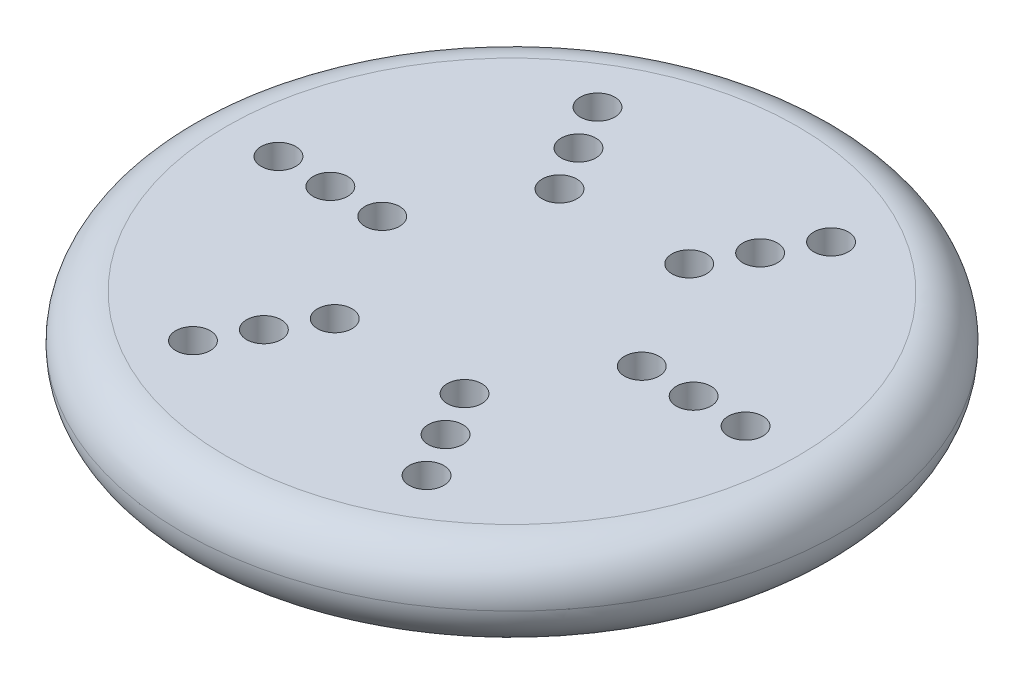
ISO-10303-21;
HEADER;
FILE_DESCRIPTION(('STEP AP214'),'2;1');
FILE_NAME('part.step','',(''),(''),'','','');
FILE_SCHEMA(('AUTOMOTIVE_DESIGN { 1 0 10303 214 1 1 1 1 }'));
ENDSEC;
DATA;
#1=APPLICATION_CONTEXT('core data for automotive mechanical design processes');
#2=APPLICATION_PROTOCOL_DEFINITION('international standard','automotive_design',2000,#1);
#3=PRODUCT_CONTEXT('',#1,'mechanical');
#4=PRODUCT('Part','Part','',(#3));
#5=PRODUCT_RELATED_PRODUCT_CATEGORY('part','',(#4));
#6=PRODUCT_DEFINITION_FORMATION('','',#4);
#7=PRODUCT_DEFINITION_CONTEXT('part definition',#1,'design');
#8=PRODUCT_DEFINITION('design','',#6,#7);
#9=PRODUCT_DEFINITION_SHAPE('','',#8);
#10=(LENGTH_UNIT() NAMED_UNIT(*) SI_UNIT(.MILLI.,.METRE.));
#11=(NAMED_UNIT(*) PLANE_ANGLE_UNIT() SI_UNIT($,.RADIAN.));
#12=(NAMED_UNIT(*) SI_UNIT($,.STERADIAN.) SOLID_ANGLE_UNIT());
#13=UNCERTAINTY_MEASURE_WITH_UNIT(LENGTH_MEASURE(1.E-05),#10,'distance_accuracy_value','');
#14=(GEOMETRIC_REPRESENTATION_CONTEXT(3) GLOBAL_UNCERTAINTY_ASSIGNED_CONTEXT((#13)) GLOBAL_UNIT_ASSIGNED_CONTEXT((#10,
#11,#12)) REPRESENTATION_CONTEXT('',''));
#15=CARTESIAN_POINT('',(0.,0.,0.));
#16=DIRECTION('',(0.,0.,1.));
#17=DIRECTION('',(1.,0.,0.));
#18=AXIS2_PLACEMENT_3D('',#15,#16,#17);
#19=CARTESIAN_POINT('',(0.,5.08,0.));
#20=DIRECTION('',(0.,1.,0.));
#21=DIRECTION('',(0.,0.,1.));
#22=AXIS2_PLACEMENT_3D('',#19,#20,#21);
#23=PLANE('',#22);
#24=CARTESIAN_POINT('',(0.,5.08,0.));
#25=DIRECTION('',(0.,1.,0.));
#26=DIRECTION('',(0.,0.,1.));
#27=AXIS2_PLACEMENT_3D('',#24,#25,#26);
#28=CIRCLE('',#27,16.51);
#29=CARTESIAN_POINT('',(0.,5.08,16.51));
#30=VERTEX_POINT('',#29);
#31=EDGE_CURVE('E10',#30,#30,#28,.T.);
#32=ORIENTED_EDGE('',*,*,#31,.T.);
#33=EDGE_LOOP('',(#32));
#34=FACE_BOUND('',#33,.T.);
#35=CARTESIAN_POINT('',(6.74999999999997,5.08,11.6913429510899));
#36=DIRECTION('',(0.,1.,0.));
#37=DIRECTION('',(0.,0.,1.));
#38=AXIS2_PLACEMENT_3D('',#35,#36,#37);
#39=CIRCLE('',#38,1.);
#40=CARTESIAN_POINT('',(6.74999999999997,5.08,12.6913429510899));
#41=VERTEX_POINT('',#40);
#42=EDGE_CURVE('E69',#41,#41,#39,.T.);
#43=ORIENTED_EDGE('',*,*,#42,.F.);
#44=EDGE_LOOP('',(#43));
#45=FACE_BOUND('',#44,.T.);
#46=CARTESIAN_POINT('',(6.75000000000014,5.08,-11.6913429510898));
#47=DIRECTION('',(0.,1.,0.));
#48=DIRECTION('',(0.,0.,1.));
#49=AXIS2_PLACEMENT_3D('',#46,#47,#48);
#50=CIRCLE('',#49,1.);
#51=CARTESIAN_POINT('',(6.75000000000014,5.08,-10.6913429510898));
#52=VERTEX_POINT('',#51);
#53=EDGE_CURVE('E103',#52,#52,#50,.T.);
#54=ORIENTED_EDGE('',*,*,#53,.F.);
#55=EDGE_LOOP('',(#54));
#56=FACE_BOUND('',#55,.T.);
#57=CARTESIAN_POINT('',(5.25000000000011,5.08,-9.09326673973654));
#58=DIRECTION('',(0.,1.,0.));
#59=DIRECTION('',(0.,0.,1.));
#60=AXIS2_PLACEMENT_3D('',#57,#58,#59);
#61=CIRCLE('',#60,1.);
#62=CARTESIAN_POINT('',(5.25000000000011,5.08,-8.09326673973654));
#63=VERTEX_POINT('',#62);
#64=EDGE_CURVE('E95',#63,#63,#61,.T.);
#65=ORIENTED_EDGE('',*,*,#64,.F.);
#66=EDGE_LOOP('',(#65));
#67=FACE_BOUND('',#66,.T.);
#68=CARTESIAN_POINT('',(3.75000000000008,5.08,-6.49519052838324));
#69=DIRECTION('',(0.,1.,0.));
#70=DIRECTION('',(0.,0.,1.));
#71=AXIS2_PLACEMENT_3D('',#68,#69,#70);
#72=CIRCLE('',#71,1.);
#73=CARTESIAN_POINT('',(3.75000000000008,5.08,-5.49519052838324));
#74=VERTEX_POINT('',#73);
#75=EDGE_CURVE('E87',#74,#74,#72,.T.);
#76=ORIENTED_EDGE('',*,*,#75,.F.);
#77=EDGE_LOOP('',(#76));
#78=FACE_BOUND('',#77,.T.);
#79=CARTESIAN_POINT('',(13.5,5.08,0.));
#80=DIRECTION('',(0.,1.,0.));
#81=DIRECTION('',(0.,0.,1.));
#82=AXIS2_PLACEMENT_3D('',#79,#80,#81);
#83=CIRCLE('',#82,1.);
#84=CARTESIAN_POINT('',(13.5,5.08,1.));
#85=VERTEX_POINT('',#84);
#86=EDGE_CURVE('E78',#85,#85,#83,.T.);
#87=ORIENTED_EDGE('',*,*,#86,.F.);
#88=EDGE_LOOP('',(#87));
#89=FACE_BOUND('',#88,.T.);
#90=CARTESIAN_POINT('',(10.5,5.08,0.));
#91=DIRECTION('',(0.,1.,0.));
#92=DIRECTION('',(0.,0.,1.));
#93=AXIS2_PLACEMENT_3D('',#90,#91,#92);
#94=CIRCLE('',#93,1.);
#95=CARTESIAN_POINT('',(10.5,5.08,1.));
#96=VERTEX_POINT('',#95);
#97=EDGE_CURVE('E79',#96,#96,#94,.T.);
#98=ORIENTED_EDGE('',*,*,#97,.F.);
#99=EDGE_LOOP('',(#98));
#100=FACE_BOUND('',#99,.T.);
#101=CARTESIAN_POINT('',(7.5,5.08,0.));
#102=DIRECTION('',(0.,1.,0.));
#103=DIRECTION('',(0.,0.,1.));
#104=AXIS2_PLACEMENT_3D('',#101,#102,#103);
#105=CIRCLE('',#104,1.);
#106=CARTESIAN_POINT('',(7.5,5.08,1.));
#107=VERTEX_POINT('',#106);
#108=EDGE_CURVE('E127',#107,#107,#105,.T.);
#109=ORIENTED_EDGE('',*,*,#108,.F.);
#110=EDGE_LOOP('',(#109));
#111=FACE_BOUND('',#110,.T.);
#112=CARTESIAN_POINT('',(3.74999999999998,5.08,6.4951905283833));
#113=DIRECTION('',(0.,1.,0.));
#114=DIRECTION('',(0.,0.,1.));
#115=AXIS2_PLACEMENT_3D('',#112,#113,#114);
#116=CIRCLE('',#115,1.);
#117=CARTESIAN_POINT('',(3.74999999999998,5.08,7.4951905283833));
#118=VERTEX_POINT('',#117);
#119=EDGE_CURVE('E119',#118,#118,#116,.T.);
#120=ORIENTED_EDGE('',*,*,#119,.F.);
#121=EDGE_LOOP('',(#120));
#122=FACE_BOUND('',#121,.T.);
#123=CARTESIAN_POINT('',(5.24999999999998,5.08,9.09326673973662));
#124=DIRECTION('',(0.,1.,0.));
#125=DIRECTION('',(0.,0.,1.));
#126=AXIS2_PLACEMENT_3D('',#123,#124,#125);
#127=CIRCLE('',#126,1.);
#128=CARTESIAN_POINT('',(5.24999999999998,5.08,10.0932667397366));
#129=VERTEX_POINT('',#128);
#130=EDGE_CURVE('E111',#129,#129,#127,.T.);
#131=ORIENTED_EDGE('',*,*,#130,.F.);
#132=EDGE_LOOP('',(#131));
#133=FACE_BOUND('',#132,.T.);
#134=CARTESIAN_POINT('',(-5.25000000000004,5.08,9.09326673973658));
#135=DIRECTION('',(0.,1.,0.));
#136=DIRECTION('',(0.,0.,1.));
#137=AXIS2_PLACEMENT_3D('',#134,#135,#136);
#138=CIRCLE('',#137,1.);
#139=CARTESIAN_POINT('',(-5.25000000000004,5.08,10.0932667397366));
#140=VERTEX_POINT('',#139);
#141=EDGE_CURVE('E61',#140,#140,#138,.T.);
#142=ORIENTED_EDGE('',*,*,#141,.F.);
#143=EDGE_LOOP('',(#142));
#144=FACE_BOUND('',#143,.T.);
#145=CARTESIAN_POINT('',(-3.75000000000003,5.08,6.49519052838327));
#146=DIRECTION('',(0.,1.,0.));
#147=DIRECTION('',(0.,0.,1.));
#148=AXIS2_PLACEMENT_3D('',#145,#146,#147);
#149=CIRCLE('',#148,1.);
#150=CARTESIAN_POINT('',(-3.75000000000003,5.08,7.49519052838327));
#151=VERTEX_POINT('',#150);
#152=EDGE_CURVE('E159',#151,#151,#149,.T.);
#153=ORIENTED_EDGE('',*,*,#152,.F.);
#154=EDGE_LOOP('',(#153));
#155=FACE_BOUND('',#154,.T.);
#156=CARTESIAN_POINT('',(-13.5,5.08,0.));
#157=DIRECTION('',(0.,1.,0.));
#158=DIRECTION('',(0.,0.,1.));
#159=AXIS2_PLACEMENT_3D('',#156,#157,#158);
#160=CIRCLE('',#159,1.);
#161=CARTESIAN_POINT('',(-13.5,5.08,1.));
#162=VERTEX_POINT('',#161);
#163=EDGE_CURVE('E151',#162,#162,#160,.T.);
#164=ORIENTED_EDGE('',*,*,#163,.F.);
#165=EDGE_LOOP('',(#164));
#166=FACE_BOUND('',#165,.T.);
#167=CARTESIAN_POINT('',(-10.5,5.08,0.));
#168=DIRECTION('',(0.,1.,0.));
#169=DIRECTION('',(0.,0.,1.));
#170=AXIS2_PLACEMENT_3D('',#167,#168,#169);
#171=CIRCLE('',#170,1.);
#172=CARTESIAN_POINT('',(-10.5,5.08,1.));
#173=VERTEX_POINT('',#172);
#174=EDGE_CURVE('E142',#173,#173,#171,.T.);
#175=ORIENTED_EDGE('',*,*,#174,.F.);
#176=EDGE_LOOP('',(#175));
#177=FACE_BOUND('',#176,.T.);
#178=CARTESIAN_POINT('',(-7.5,5.08,0.));
#179=DIRECTION('',(0.,1.,0.));
#180=DIRECTION('',(0.,0.,1.));
#181=AXIS2_PLACEMENT_3D('',#178,#179,#180);
#182=CIRCLE('',#181,1.);
#183=CARTESIAN_POINT('',(-7.5,5.08,1.));
#184=VERTEX_POINT('',#183);
#185=EDGE_CURVE('E143',#184,#184,#182,.T.);
#186=ORIENTED_EDGE('',*,*,#185,.F.);
#187=EDGE_LOOP('',(#186));
#188=FACE_BOUND('',#187,.T.);
#189=CARTESIAN_POINT('',(-3.74999999999994,5.08,-6.49519052838332));
#190=DIRECTION('',(0.,1.,0.));
#191=DIRECTION('',(0.,0.,1.));
#192=AXIS2_PLACEMENT_3D('',#189,#190,#191);
#193=CIRCLE('',#192,1.);
#194=CARTESIAN_POINT('',(-3.74999999999994,5.08,-5.49519052838332));
#195=VERTEX_POINT('',#194);
#196=EDGE_CURVE('E189',#195,#195,#193,.T.);
#197=ORIENTED_EDGE('',*,*,#196,.F.);
#198=EDGE_LOOP('',(#197));
#199=FACE_BOUND('',#198,.T.);
#200=CARTESIAN_POINT('',(-5.24999999999992,5.08,-9.09326673973665));
#201=DIRECTION('',(0.,1.,0.));
#202=DIRECTION('',(0.,0.,1.));
#203=AXIS2_PLACEMENT_3D('',#200,#201,#202);
#204=CIRCLE('',#203,1.);
#205=CARTESIAN_POINT('',(-5.24999999999992,5.08,-8.09326673973665));
#206=VERTEX_POINT('',#205);
#207=EDGE_CURVE('E181',#206,#206,#204,.T.);
#208=ORIENTED_EDGE('',*,*,#207,.F.);
#209=EDGE_LOOP('',(#208));
#210=FACE_BOUND('',#209,.T.);
#211=CARTESIAN_POINT('',(-6.74999999999989,5.08,-11.69134295109));
#212=DIRECTION('',(0.,1.,0.));
#213=DIRECTION('',(0.,0.,1.));
#214=AXIS2_PLACEMENT_3D('',#211,#212,#213);
#215=CIRCLE('',#214,1.);
#216=CARTESIAN_POINT('',(-6.74999999999989,5.08,-10.69134295109));
#217=VERTEX_POINT('',#216);
#218=EDGE_CURVE('E173',#217,#217,#215,.T.);
#219=ORIENTED_EDGE('',*,*,#218,.F.);
#220=EDGE_LOOP('',(#219));
#221=FACE_BOUND('',#220,.T.);
#222=CARTESIAN_POINT('',(-6.75000000000006,5.08,11.6913429510899));
#223=DIRECTION('',(0.,1.,0.));
#224=DIRECTION('',(0.,0.,1.));
#225=AXIS2_PLACEMENT_3D('',#222,#223,#224);
#226=CIRCLE('',#225,1.);
#227=CARTESIAN_POINT('',(-6.75000000000006,5.08,12.6913429510899));
#228=VERTEX_POINT('',#227);
#229=EDGE_CURVE('E57',#228,#228,#226,.T.);
#230=ORIENTED_EDGE('',*,*,#229,.F.);
#231=EDGE_LOOP('',(#230));
#232=FACE_BOUND('',#231,.T.);
#233=ADVANCED_FACE('F40',(#34,#45,#56,#67,#78,#89,#100,#111,#122,#133,#144,#155,#166,#177,#188,
#199,#210,#221,#232),#23,.T.);
#234=CARTESIAN_POINT('',(0.,0.,0.));
#235=DIRECTION('',(0.,1.,0.));
#236=DIRECTION('',(0.,0.,1.));
#237=AXIS2_PLACEMENT_3D('',#234,#235,#236);
#238=PLANE('',#237);
#239=CARTESIAN_POINT('',(0.,0.,0.));
#240=DIRECTION('',(0.,1.,0.));
#241=DIRECTION('',(0.,0.,1.));
#242=AXIS2_PLACEMENT_3D('',#239,#240,#241);
#243=CIRCLE('',#242,16.51);
#244=CARTESIAN_POINT('',(0.,0.,16.51));
#245=VERTEX_POINT('',#244);
#246=EDGE_CURVE('E49',#245,#245,#243,.F.);
#247=ORIENTED_EDGE('',*,*,#246,.T.);
#248=EDGE_LOOP('',(#247));
#249=FACE_BOUND('',#248,.T.);
#250=CARTESIAN_POINT('',(6.74999999999997,0.,11.6913429510899));
#251=DIRECTION('',(0.,1.,0.));
#252=DIRECTION('',(0.,0.,1.));
#253=AXIS2_PLACEMENT_3D('',#250,#251,#252);
#254=CIRCLE('',#253,1.);
#255=CARTESIAN_POINT('',(6.74999999999997,0.,12.6913429510899));
#256=VERTEX_POINT('',#255);
#257=EDGE_CURVE('E65',#256,#256,#254,.T.);
#258=ORIENTED_EDGE('',*,*,#257,.T.);
#259=EDGE_LOOP('',(#258));
#260=FACE_BOUND('',#259,.T.);
#261=CARTESIAN_POINT('',(6.75000000000014,0.,-11.6913429510898));
#262=DIRECTION('',(0.,1.,0.));
#263=DIRECTION('',(0.,0.,1.));
#264=AXIS2_PLACEMENT_3D('',#261,#262,#263);
#265=CIRCLE('',#264,1.);
#266=CARTESIAN_POINT('',(6.75000000000014,0.,-10.6913429510898));
#267=VERTEX_POINT('',#266);
#268=EDGE_CURVE('E99',#267,#267,#265,.T.);
#269=ORIENTED_EDGE('',*,*,#268,.T.);
#270=EDGE_LOOP('',(#269));
#271=FACE_BOUND('',#270,.T.);
#272=CARTESIAN_POINT('',(5.25000000000011,0.,-9.09326673973654));
#273=DIRECTION('',(0.,1.,0.));
#274=DIRECTION('',(0.,0.,1.));
#275=AXIS2_PLACEMENT_3D('',#272,#273,#274);
#276=CIRCLE('',#275,1.);
#277=CARTESIAN_POINT('',(5.25000000000011,0.,-8.09326673973654));
#278=VERTEX_POINT('',#277);
#279=EDGE_CURVE('E91',#278,#278,#276,.T.);
#280=ORIENTED_EDGE('',*,*,#279,.T.);
#281=EDGE_LOOP('',(#280));
#282=FACE_BOUND('',#281,.T.);
#283=CARTESIAN_POINT('',(3.75000000000008,0.,-6.49519052838324));
#284=DIRECTION('',(0.,1.,0.));
#285=DIRECTION('',(0.,0.,1.));
#286=AXIS2_PLACEMENT_3D('',#283,#284,#285);
#287=CIRCLE('',#286,1.);
#288=CARTESIAN_POINT('',(3.75000000000008,0.,-5.49519052838324));
#289=VERTEX_POINT('',#288);
#290=EDGE_CURVE('E83',#289,#289,#287,.T.);
#291=ORIENTED_EDGE('',*,*,#290,.T.);
#292=EDGE_LOOP('',(#291));
#293=FACE_BOUND('',#292,.T.);
#294=CARTESIAN_POINT('',(13.5,0.,0.));
#295=DIRECTION('',(0.,1.,0.));
#296=DIRECTION('',(0.,0.,1.));
#297=AXIS2_PLACEMENT_3D('',#294,#295,#296);
#298=CIRCLE('',#297,1.);
#299=CARTESIAN_POINT('',(13.5,0.,1.));
#300=VERTEX_POINT('',#299);
#301=EDGE_CURVE('E74',#300,#300,#298,.T.);
#302=ORIENTED_EDGE('',*,*,#301,.T.);
#303=EDGE_LOOP('',(#302));
#304=FACE_BOUND('',#303,.T.);
#305=CARTESIAN_POINT('',(10.5,0.,0.));
#306=DIRECTION('',(0.,1.,0.));
#307=DIRECTION('',(0.,0.,1.));
#308=AXIS2_PLACEMENT_3D('',#305,#306,#307);
#309=CIRCLE('',#308,1.);
#310=CARTESIAN_POINT('',(10.5,0.,1.));
#311=VERTEX_POINT('',#310);
#312=EDGE_CURVE('E131',#311,#311,#309,.T.);
#313=ORIENTED_EDGE('',*,*,#312,.T.);
#314=EDGE_LOOP('',(#313));
#315=FACE_BOUND('',#314,.T.);
#316=CARTESIAN_POINT('',(7.5,0.,0.));
#317=DIRECTION('',(0.,1.,0.));
#318=DIRECTION('',(0.,0.,1.));
#319=AXIS2_PLACEMENT_3D('',#316,#317,#318);
#320=CIRCLE('',#319,1.);
#321=CARTESIAN_POINT('',(7.5,0.,1.));
#322=VERTEX_POINT('',#321);
#323=EDGE_CURVE('E123',#322,#322,#320,.T.);
#324=ORIENTED_EDGE('',*,*,#323,.T.);
#325=EDGE_LOOP('',(#324));
#326=FACE_BOUND('',#325,.T.);
#327=CARTESIAN_POINT('',(3.74999999999998,0.,6.4951905283833));
#328=DIRECTION('',(0.,1.,0.));
#329=DIRECTION('',(0.,0.,1.));
#330=AXIS2_PLACEMENT_3D('',#327,#328,#329);
#331=CIRCLE('',#330,1.);
#332=CARTESIAN_POINT('',(3.74999999999998,0.,7.4951905283833));
#333=VERTEX_POINT('',#332);
#334=EDGE_CURVE('E115',#333,#333,#331,.T.);
#335=ORIENTED_EDGE('',*,*,#334,.T.);
#336=EDGE_LOOP('',(#335));
#337=FACE_BOUND('',#336,.T.);
#338=CARTESIAN_POINT('',(5.24999999999998,0.,9.09326673973662));
#339=DIRECTION('',(0.,1.,0.));
#340=DIRECTION('',(0.,0.,1.));
#341=AXIS2_PLACEMENT_3D('',#338,#339,#340);
#342=CIRCLE('',#341,1.);
#343=CARTESIAN_POINT('',(5.24999999999998,0.,10.0932667397366));
#344=VERTEX_POINT('',#343);
#345=EDGE_CURVE('E73',#344,#344,#342,.T.);
#346=ORIENTED_EDGE('',*,*,#345,.T.);
#347=EDGE_LOOP('',(#346));
#348=FACE_BOUND('',#347,.T.);
#349=CARTESIAN_POINT('',(-5.25000000000004,0.,9.09326673973658));
#350=DIRECTION('',(0.,1.,0.));
#351=DIRECTION('',(0.,0.,1.));
#352=AXIS2_PLACEMENT_3D('',#349,#350,#351);
#353=CIRCLE('',#352,1.);
#354=CARTESIAN_POINT('',(-5.25000000000004,0.,10.0932667397366));
#355=VERTEX_POINT('',#354);
#356=EDGE_CURVE('E163',#355,#355,#353,.T.);
#357=ORIENTED_EDGE('',*,*,#356,.T.);
#358=EDGE_LOOP('',(#357));
#359=FACE_BOUND('',#358,.T.);
#360=CARTESIAN_POINT('',(-3.75000000000003,0.,6.49519052838327));
#361=DIRECTION('',(0.,1.,0.));
#362=DIRECTION('',(0.,0.,1.));
#363=AXIS2_PLACEMENT_3D('',#360,#361,#362);
#364=CIRCLE('',#363,1.);
#365=CARTESIAN_POINT('',(-3.75000000000003,0.,7.49519052838327));
#366=VERTEX_POINT('',#365);
#367=EDGE_CURVE('E155',#366,#366,#364,.T.);
#368=ORIENTED_EDGE('',*,*,#367,.T.);
#369=EDGE_LOOP('',(#368));
#370=FACE_BOUND('',#369,.T.);
#371=CARTESIAN_POINT('',(-13.5,0.,0.));
#372=DIRECTION('',(0.,1.,0.));
#373=DIRECTION('',(0.,0.,1.));
#374=AXIS2_PLACEMENT_3D('',#371,#372,#373);
#375=CIRCLE('',#374,1.);
#376=CARTESIAN_POINT('',(-13.5,0.,1.));
#377=VERTEX_POINT('',#376);
#378=EDGE_CURVE('E147',#377,#377,#375,.T.);
#379=ORIENTED_EDGE('',*,*,#378,.T.);
#380=EDGE_LOOP('',(#379));
#381=FACE_BOUND('',#380,.T.);
#382=CARTESIAN_POINT('',(-10.5,0.,0.));
#383=DIRECTION('',(0.,1.,0.));
#384=DIRECTION('',(0.,0.,1.));
#385=AXIS2_PLACEMENT_3D('',#382,#383,#384);
#386=CIRCLE('',#385,1.);
#387=CARTESIAN_POINT('',(-10.5,0.,1.));
#388=VERTEX_POINT('',#387);
#389=EDGE_CURVE('E138',#388,#388,#386,.T.);
#390=ORIENTED_EDGE('',*,*,#389,.T.);
#391=EDGE_LOOP('',(#390));
#392=FACE_BOUND('',#391,.T.);
#393=CARTESIAN_POINT('',(-7.5,0.,0.));
#394=DIRECTION('',(0.,1.,0.));
#395=DIRECTION('',(0.,0.,1.));
#396=AXIS2_PLACEMENT_3D('',#393,#394,#395);
#397=CIRCLE('',#396,1.);
#398=CARTESIAN_POINT('',(-7.5,0.,1.));
#399=VERTEX_POINT('',#398);
#400=EDGE_CURVE('E193',#399,#399,#397,.T.);
#401=ORIENTED_EDGE('',*,*,#400,.T.);
#402=EDGE_LOOP('',(#401));
#403=FACE_BOUND('',#402,.T.);
#404=CARTESIAN_POINT('',(-3.74999999999994,0.,-6.49519052838332));
#405=DIRECTION('',(0.,1.,0.));
#406=DIRECTION('',(0.,0.,1.));
#407=AXIS2_PLACEMENT_3D('',#404,#405,#406);
#408=CIRCLE('',#407,1.);
#409=CARTESIAN_POINT('',(-3.74999999999994,0.,-5.49519052838332));
#410=VERTEX_POINT('',#409);
#411=EDGE_CURVE('E185',#410,#410,#408,.T.);
#412=ORIENTED_EDGE('',*,*,#411,.T.);
#413=EDGE_LOOP('',(#412));
#414=FACE_BOUND('',#413,.T.);
#415=CARTESIAN_POINT('',(-5.24999999999992,0.,-9.09326673973665));
#416=DIRECTION('',(0.,1.,0.));
#417=DIRECTION('',(0.,0.,1.));
#418=AXIS2_PLACEMENT_3D('',#415,#416,#417);
#419=CIRCLE('',#418,1.);
#420=CARTESIAN_POINT('',(-5.24999999999992,0.,-8.09326673973665));
#421=VERTEX_POINT('',#420);
#422=EDGE_CURVE('E177',#421,#421,#419,.T.);
#423=ORIENTED_EDGE('',*,*,#422,.T.);
#424=EDGE_LOOP('',(#423));
#425=FACE_BOUND('',#424,.T.);
#426=CARTESIAN_POINT('',(-6.74999999999989,0.,-11.69134295109));
#427=DIRECTION('',(0.,1.,0.));
#428=DIRECTION('',(0.,0.,1.));
#429=AXIS2_PLACEMENT_3D('',#426,#427,#428);
#430=CIRCLE('',#429,1.);
#431=CARTESIAN_POINT('',(-6.74999999999989,0.,-10.69134295109));
#432=VERTEX_POINT('',#431);
#433=EDGE_CURVE('E107',#432,#432,#430,.T.);
#434=ORIENTED_EDGE('',*,*,#433,.T.);
#435=EDGE_LOOP('',(#434));
#436=FACE_BOUND('',#435,.T.);
#437=CARTESIAN_POINT('',(-6.75000000000006,0.,11.6913429510899));
#438=DIRECTION('',(0.,1.,0.));
#439=DIRECTION('',(0.,0.,1.));
#440=AXIS2_PLACEMENT_3D('',#437,#438,#439);
#441=CIRCLE('',#440,1.);
#442=CARTESIAN_POINT('',(-6.75000000000006,0.,12.6913429510899));
#443=VERTEX_POINT('',#442);
#444=EDGE_CURVE('E54',#443,#443,#441,.T.);
#445=ORIENTED_EDGE('',*,*,#444,.T.);
#446=EDGE_LOOP('',(#445));
#447=FACE_BOUND('',#446,.T.);
#448=ADVANCED_FACE('F205',(#249,#260,#271,#282,#293,#304,#315,#326,#337,#348,#359,#370,#381,
#392,#403,#414,#425,#436,#447),#238,.F.);
#449=CARTESIAN_POINT('',(-6.75000000000006,0.,11.6913429510899));
#450=DIRECTION('',(0.,1.,0.));
#451=DIRECTION('',(0.,0.,1.));
#452=AXIS2_PLACEMENT_3D('',#449,#450,#451);
#453=CYLINDRICAL_SURFACE('',#452,1.);
#454=ORIENTED_EDGE('',*,*,#444,.F.);
#455=EDGE_LOOP('',(#454));
#456=FACE_BOUND('',#455,.T.);
#457=ORIENTED_EDGE('',*,*,#229,.T.);
#458=EDGE_LOOP('',(#457));
#459=FACE_BOUND('',#458,.T.);
#460=ADVANCED_FACE('F215',(#456,#459),#453,.F.);
#461=CARTESIAN_POINT('',(-6.74999999999989,0.,-11.69134295109));
#462=DIRECTION('',(0.,1.,0.));
#463=DIRECTION('',(0.,0.,1.));
#464=AXIS2_PLACEMENT_3D('',#461,#462,#463);
#465=CYLINDRICAL_SURFACE('',#464,1.);
#466=ORIENTED_EDGE('',*,*,#433,.F.);
#467=EDGE_LOOP('',(#466));
#468=FACE_BOUND('',#467,.T.);
#469=ORIENTED_EDGE('',*,*,#218,.T.);
#470=EDGE_LOOP('',(#469));
#471=FACE_BOUND('',#470,.T.);
#472=ADVANCED_FACE('F217',(#468,#471),#465,.F.);
#473=CARTESIAN_POINT('',(-5.24999999999992,0.,-9.09326673973665));
#474=DIRECTION('',(0.,1.,0.));
#475=DIRECTION('',(0.,0.,1.));
#476=AXIS2_PLACEMENT_3D('',#473,#474,#475);
#477=CYLINDRICAL_SURFACE('',#476,1.);
#478=ORIENTED_EDGE('',*,*,#422,.F.);
#479=EDGE_LOOP('',(#478));
#480=FACE_BOUND('',#479,.T.);
#481=ORIENTED_EDGE('',*,*,#207,.T.);
#482=EDGE_LOOP('',(#481));
#483=FACE_BOUND('',#482,.T.);
#484=ADVANCED_FACE('F224',(#480,#483),#477,.F.);
#485=CARTESIAN_POINT('',(-3.74999999999994,0.,-6.49519052838332));
#486=DIRECTION('',(0.,1.,0.));
#487=DIRECTION('',(0.,0.,1.));
#488=AXIS2_PLACEMENT_3D('',#485,#486,#487);
#489=CYLINDRICAL_SURFACE('',#488,1.);
#490=ORIENTED_EDGE('',*,*,#411,.F.);
#491=EDGE_LOOP('',(#490));
#492=FACE_BOUND('',#491,.T.);
#493=ORIENTED_EDGE('',*,*,#196,.T.);
#494=EDGE_LOOP('',(#493));
#495=FACE_BOUND('',#494,.T.);
#496=ADVANCED_FACE('F286',(#492,#495),#489,.F.);
#497=CARTESIAN_POINT('',(-7.5,0.,0.));
#498=DIRECTION('',(0.,1.,0.));
#499=DIRECTION('',(0.,0.,1.));
#500=AXIS2_PLACEMENT_3D('',#497,#498,#499);
#501=CYLINDRICAL_SURFACE('',#500,1.);
#502=ORIENTED_EDGE('',*,*,#400,.F.);
#503=EDGE_LOOP('',(#502));
#504=FACE_BOUND('',#503,.T.);
#505=ORIENTED_EDGE('',*,*,#185,.T.);
#506=EDGE_LOOP('',(#505));
#507=FACE_BOUND('',#506,.T.);
#508=ADVANCED_FACE('F201',(#504,#507),#501,.F.);
#509=CARTESIAN_POINT('',(-10.5,0.,0.));
#510=DIRECTION('',(0.,1.,0.));
#511=DIRECTION('',(0.,0.,1.));
#512=AXIS2_PLACEMENT_3D('',#509,#510,#511);
#513=CYLINDRICAL_SURFACE('',#512,1.);
#514=ORIENTED_EDGE('',*,*,#389,.F.);
#515=EDGE_LOOP('',(#514));
#516=FACE_BOUND('',#515,.T.);
#517=ORIENTED_EDGE('',*,*,#174,.T.);
#518=EDGE_LOOP('',(#517));
#519=FACE_BOUND('',#518,.T.);
#520=ADVANCED_FACE('F307',(#516,#519),#513,.F.);
#521=CARTESIAN_POINT('',(-13.5,0.,0.));
#522=DIRECTION('',(0.,1.,0.));
#523=DIRECTION('',(0.,0.,1.));
#524=AXIS2_PLACEMENT_3D('',#521,#522,#523);
#525=CYLINDRICAL_SURFACE('',#524,1.);
#526=ORIENTED_EDGE('',*,*,#378,.F.);
#527=EDGE_LOOP('',(#526));
#528=FACE_BOUND('',#527,.T.);
#529=ORIENTED_EDGE('',*,*,#163,.T.);
#530=EDGE_LOOP('',(#529));
#531=FACE_BOUND('',#530,.T.);
#532=ADVANCED_FACE('F303',(#528,#531),#525,.F.);
#533=CARTESIAN_POINT('',(-3.75000000000003,0.,6.49519052838327));
#534=DIRECTION('',(0.,1.,0.));
#535=DIRECTION('',(0.,0.,1.));
#536=AXIS2_PLACEMENT_3D('',#533,#534,#535);
#537=CYLINDRICAL_SURFACE('',#536,1.);
#538=ORIENTED_EDGE('',*,*,#367,.F.);
#539=EDGE_LOOP('',(#538));
#540=FACE_BOUND('',#539,.T.);
#541=ORIENTED_EDGE('',*,*,#152,.T.);
#542=EDGE_LOOP('',(#541));
#543=FACE_BOUND('',#542,.T.);
#544=ADVANCED_FACE('F299',(#540,#543),#537,.F.);
#545=CARTESIAN_POINT('',(-5.25000000000004,0.,9.09326673973658));
#546=DIRECTION('',(0.,1.,0.));
#547=DIRECTION('',(0.,0.,1.));
#548=AXIS2_PLACEMENT_3D('',#545,#546,#547);
#549=CYLINDRICAL_SURFACE('',#548,1.);
#550=ORIENTED_EDGE('',*,*,#356,.F.);
#551=EDGE_LOOP('',(#550));
#552=FACE_BOUND('',#551,.T.);
#553=ORIENTED_EDGE('',*,*,#141,.T.);
#554=EDGE_LOOP('',(#553));
#555=FACE_BOUND('',#554,.T.);
#556=ADVANCED_FACE('F295',(#552,#555),#549,.F.);
#557=CARTESIAN_POINT('',(5.24999999999998,0.,9.09326673973662));
#558=DIRECTION('',(0.,1.,0.));
#559=DIRECTION('',(0.,0.,1.));
#560=AXIS2_PLACEMENT_3D('',#557,#558,#559);
#561=CYLINDRICAL_SURFACE('',#560,1.);
#562=ORIENTED_EDGE('',*,*,#345,.F.);
#563=EDGE_LOOP('',(#562));
#564=FACE_BOUND('',#563,.T.);
#565=ORIENTED_EDGE('',*,*,#130,.T.);
#566=EDGE_LOOP('',(#565));
#567=FACE_BOUND('',#566,.T.);
#568=ADVANCED_FACE('F298',(#564,#567),#561,.F.);
#569=CARTESIAN_POINT('',(3.74999999999998,0.,6.4951905283833));
#570=DIRECTION('',(0.,1.,0.));
#571=DIRECTION('',(0.,0.,1.));
#572=AXIS2_PLACEMENT_3D('',#569,#570,#571);
#573=CYLINDRICAL_SURFACE('',#572,1.);
#574=ORIENTED_EDGE('',*,*,#334,.F.);
#575=EDGE_LOOP('',(#574));
#576=FACE_BOUND('',#575,.T.);
#577=ORIENTED_EDGE('',*,*,#119,.T.);
#578=EDGE_LOOP('',(#577));
#579=FACE_BOUND('',#578,.T.);
#580=ADVANCED_FACE('F320',(#576,#579),#573,.F.);
#581=CARTESIAN_POINT('',(7.5,0.,0.));
#582=DIRECTION('',(0.,1.,0.));
#583=DIRECTION('',(0.,0.,1.));
#584=AXIS2_PLACEMENT_3D('',#581,#582,#583);
#585=CYLINDRICAL_SURFACE('',#584,1.);
#586=ORIENTED_EDGE('',*,*,#323,.F.);
#587=EDGE_LOOP('',(#586));
#588=FACE_BOUND('',#587,.T.);
#589=ORIENTED_EDGE('',*,*,#108,.T.);
#590=EDGE_LOOP('',(#589));
#591=FACE_BOUND('',#590,.T.);
#592=ADVANCED_FACE('F316',(#588,#591),#585,.F.);
#593=CARTESIAN_POINT('',(10.5,0.,0.));
#594=DIRECTION('',(0.,1.,0.));
#595=DIRECTION('',(0.,0.,1.));
#596=AXIS2_PLACEMENT_3D('',#593,#594,#595);
#597=CYLINDRICAL_SURFACE('',#596,1.);
#598=ORIENTED_EDGE('',*,*,#312,.F.);
#599=EDGE_LOOP('',(#598));
#600=FACE_BOUND('',#599,.T.);
#601=ORIENTED_EDGE('',*,*,#97,.T.);
#602=EDGE_LOOP('',(#601));
#603=FACE_BOUND('',#602,.T.);
#604=ADVANCED_FACE('F312',(#600,#603),#597,.F.);
#605=CARTESIAN_POINT('',(13.5,0.,0.));
#606=DIRECTION('',(0.,1.,0.));
#607=DIRECTION('',(0.,0.,1.));
#608=AXIS2_PLACEMENT_3D('',#605,#606,#607);
#609=CYLINDRICAL_SURFACE('',#608,1.);
#610=ORIENTED_EDGE('',*,*,#301,.F.);
#611=EDGE_LOOP('',(#610));
#612=FACE_BOUND('',#611,.T.);
#613=ORIENTED_EDGE('',*,*,#86,.T.);
#614=EDGE_LOOP('',(#613));
#615=FACE_BOUND('',#614,.T.);
#616=ADVANCED_FACE('F315',(#612,#615),#609,.F.);
#617=CARTESIAN_POINT('',(3.75000000000008,0.,-6.49519052838324));
#618=DIRECTION('',(0.,1.,0.));
#619=DIRECTION('',(0.,0.,1.));
#620=AXIS2_PLACEMENT_3D('',#617,#618,#619);
#621=CYLINDRICAL_SURFACE('',#620,1.);
#622=ORIENTED_EDGE('',*,*,#290,.F.);
#623=EDGE_LOOP('',(#622));
#624=FACE_BOUND('',#623,.T.);
#625=ORIENTED_EDGE('',*,*,#75,.T.);
#626=EDGE_LOOP('',(#625));
#627=FACE_BOUND('',#626,.T.);
#628=ADVANCED_FACE('F335',(#624,#627),#621,.F.);
#629=CARTESIAN_POINT('',(5.25000000000011,0.,-9.09326673973654));
#630=DIRECTION('',(0.,1.,0.));
#631=DIRECTION('',(0.,0.,1.));
#632=AXIS2_PLACEMENT_3D('',#629,#630,#631);
#633=CYLINDRICAL_SURFACE('',#632,1.);
#634=ORIENTED_EDGE('',*,*,#279,.F.);
#635=EDGE_LOOP('',(#634));
#636=FACE_BOUND('',#635,.T.);
#637=ORIENTED_EDGE('',*,*,#64,.T.);
#638=EDGE_LOOP('',(#637));
#639=FACE_BOUND('',#638,.T.);
#640=ADVANCED_FACE('F331',(#636,#639),#633,.F.);
#641=CARTESIAN_POINT('',(6.75000000000014,0.,-11.6913429510898));
#642=DIRECTION('',(0.,1.,0.));
#643=DIRECTION('',(0.,0.,1.));
#644=AXIS2_PLACEMENT_3D('',#641,#642,#643);
#645=CYLINDRICAL_SURFACE('',#644,1.);
#646=ORIENTED_EDGE('',*,*,#268,.F.);
#647=EDGE_LOOP('',(#646));
#648=FACE_BOUND('',#647,.T.);
#649=ORIENTED_EDGE('',*,*,#53,.T.);
#650=EDGE_LOOP('',(#649));
#651=FACE_BOUND('',#650,.T.);
#652=ADVANCED_FACE('F328',(#648,#651),#645,.F.);
#653=CARTESIAN_POINT('',(6.74999999999997,0.,11.6913429510899));
#654=DIRECTION('',(0.,1.,0.));
#655=DIRECTION('',(0.,0.,1.));
#656=AXIS2_PLACEMENT_3D('',#653,#654,#655);
#657=CYLINDRICAL_SURFACE('',#656,1.);
#658=ORIENTED_EDGE('',*,*,#257,.F.);
#659=EDGE_LOOP('',(#658));
#660=FACE_BOUND('',#659,.T.);
#661=ORIENTED_EDGE('',*,*,#42,.T.);
#662=EDGE_LOOP('',(#661));
#663=FACE_BOUND('',#662,.T.);
#664=ADVANCED_FACE('F232',(#660,#663),#657,.F.);
#665=CARTESIAN_POINT('',(0.,2.54,0.));
#666=DIRECTION('',(0.,1.,0.));
#667=DIRECTION('',(0.,0.,1.));
#668=AXIS2_PLACEMENT_3D('',#665,#666,#667);
#669=TOROIDAL_SURFACE('',#668,16.51,2.54);
#670=ORIENTED_EDGE('',*,*,#31,.F.);
#671=EDGE_LOOP('',(#670));
#672=FACE_BOUND('',#671,.T.);
#673=CARTESIAN_POINT('',(0.,2.54,0.));
#674=DIRECTION('',(0.,1.,0.));
#675=DIRECTION('',(0.,0.,1.));
#676=AXIS2_PLACEMENT_3D('',#673,#674,#675);
#677=CIRCLE('',#676,19.05);
#678=CARTESIAN_POINT('',(0.,2.54,19.05));
#679=VERTEX_POINT('',#678);
#680=EDGE_CURVE('E44',#679,#679,#677,.F.);
#681=ORIENTED_EDGE('',*,*,#680,.F.);
#682=EDGE_LOOP('',(#681));
#683=FACE_BOUND('',#682,.T.);
#684=ADVANCED_FACE('F42',(#672,#683),#669,.T.);
#685=CARTESIAN_POINT('',(0.,2.54,0.));
#686=DIRECTION('',(0.,1.,0.));
#687=DIRECTION('',(0.,0.,1.));
#688=AXIS2_PLACEMENT_3D('',#685,#686,#687);
#689=TOROIDAL_SURFACE('',#688,16.51,2.54);
#690=ORIENTED_EDGE('',*,*,#246,.F.);
#691=EDGE_LOOP('',(#690));
#692=FACE_BOUND('',#691,.T.);
#693=ORIENTED_EDGE('',*,*,#680,.T.);
#694=EDGE_LOOP('',(#693));
#695=FACE_BOUND('',#694,.T.);
#696=ADVANCED_FACE('F234',(#692,#695),#689,.T.);
#697=CLOSED_SHELL('',(#233,#448,#460,#472,#484,#496,#508,#520,#532,#544,#556,#568,#580,#592,
#604,#616,#628,#640,#652,#664,#684,#696));
#698=MANIFOLD_SOLID_BREP('B2',#697);
#699=ADVANCED_BREP_SHAPE_REPRESENTATION('',(#18,#698),#14);
#700=SHAPE_DEFINITION_REPRESENTATION(#9,#699);
ENDSEC;
END-ISO-10303-21;
